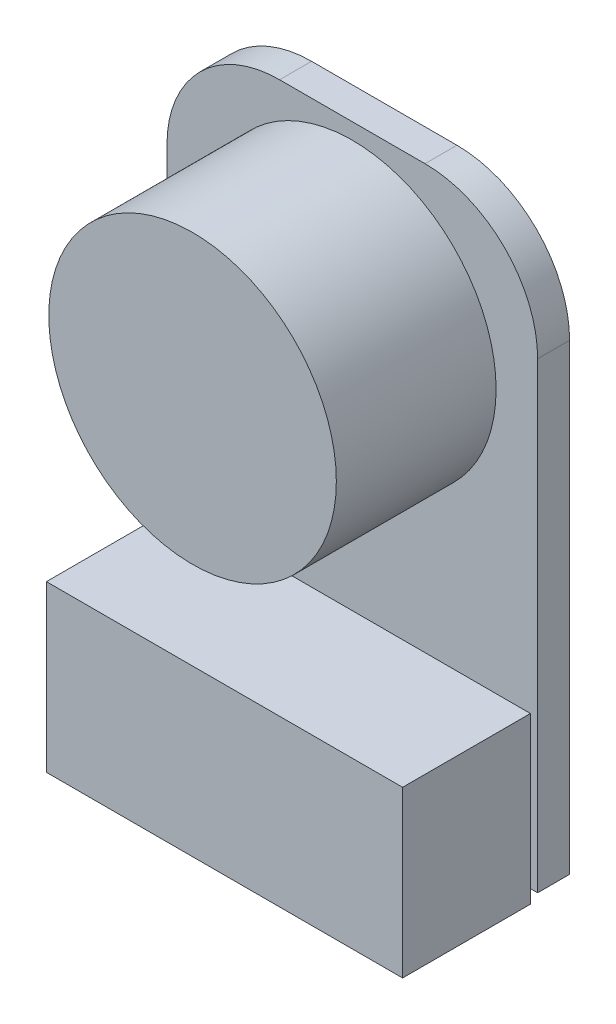
ISO-10303-21;
HEADER;
FILE_DESCRIPTION(('STEP AP214'),'2;1');
FILE_NAME('part.step','',(''),(''),'','','');
FILE_SCHEMA(('AUTOMOTIVE_DESIGN { 1 0 10303 214 1 1 1 1 }'));
ENDSEC;
DATA;
#1=APPLICATION_CONTEXT('core data for automotive mechanical design processes');
#2=APPLICATION_PROTOCOL_DEFINITION('international standard','automotive_design',2000,#1);
#3=PRODUCT_CONTEXT('',#1,'mechanical');
#4=PRODUCT('Part','Part','',(#3));
#5=PRODUCT_RELATED_PRODUCT_CATEGORY('part','',(#4));
#6=PRODUCT_DEFINITION_FORMATION('','',#4);
#7=PRODUCT_DEFINITION_CONTEXT('part definition',#1,'design');
#8=PRODUCT_DEFINITION('design','',#6,#7);
#9=PRODUCT_DEFINITION_SHAPE('','',#8);
#10=(LENGTH_UNIT() NAMED_UNIT(*) SI_UNIT(.MILLI.,.METRE.));
#11=(NAMED_UNIT(*) PLANE_ANGLE_UNIT() SI_UNIT($,.RADIAN.));
#12=(NAMED_UNIT(*) SI_UNIT($,.STERADIAN.) SOLID_ANGLE_UNIT());
#13=UNCERTAINTY_MEASURE_WITH_UNIT(LENGTH_MEASURE(1.E-05),#10,'distance_accuracy_value','');
#14=(GEOMETRIC_REPRESENTATION_CONTEXT(3) GLOBAL_UNCERTAINTY_ASSIGNED_CONTEXT((#13)) GLOBAL_UNIT_ASSIGNED_CONTEXT((#10,
#11,#12)) REPRESENTATION_CONTEXT('',''));
#15=CARTESIAN_POINT('',(0.,0.,0.));
#16=DIRECTION('',(0.,0.,1.));
#17=DIRECTION('',(1.,0.,0.));
#18=AXIS2_PLACEMENT_3D('',#15,#16,#17);
#19=CARTESIAN_POINT('',(2.27500741064341,1.4743834517031,1.));
#20=DIRECTION('',(0.,0.,1.));
#21=DIRECTION('',(1.,0.,0.));
#22=AXIS2_PLACEMENT_3D('',#19,#20,#21);
#23=PLANE('',#22);
#24=CARTESIAN_POINT('',(0.,0.,1.));
#25=DIRECTION('',(0.,0.,1.));
#26=DIRECTION('',(1.,0.,0.));
#27=AXIS2_PLACEMENT_3D('',#24,#25,#26);
#28=CIRCLE('',#27,4.5);
#29=CARTESIAN_POINT('',(4.5,0.,1.));
#30=VERTEX_POINT('',#29);
#31=EDGE_CURVE('E48',#30,#30,#28,.T.);
#32=ORIENTED_EDGE('',*,*,#31,.F.);
#33=EDGE_LOOP('',(#32));
#34=FACE_BOUND('',#33,.T.);
#35=DIRECTION('',(-1.,0.,0.));
#36=VECTOR('',#35,1.);
#37=CARTESIAN_POINT('',(-5.57418792924603,-8.25322151892993,1.));
#38=LINE('',#37,#36);
#39=CARTESIAN_POINT('',(5.57418792924603,-8.25322151892993,1.));
#40=VERTEX_POINT('',#39);
#41=CARTESIAN_POINT('',(-5.57418792924603,-8.25322151892993,1.));
#42=VERTEX_POINT('',#41);
#43=EDGE_CURVE('E392',#40,#42,#38,.T.);
#44=ORIENTED_EDGE('',*,*,#43,.F.);
#45=DIRECTION('',(0.,-1.,0.));
#46=VECTOR('',#45,1.);
#47=CARTESIAN_POINT('',(5.57418792924603,1.4743834517031,1.));
#48=LINE('',#47,#46);
#49=CARTESIAN_POINT('',(5.57418792924603,-13.,1.));
#50=VERTEX_POINT('',#49);
#51=EDGE_CURVE('E11',#40,#50,#48,.T.);
#52=ORIENTED_EDGE('',*,*,#51,.T.);
#53=DIRECTION('',(1.,0.,0.));
#54=VECTOR('',#53,1.);
#55=CARTESIAN_POINT('',(-5.80062395894031,-13.,1.));
#56=LINE('',#55,#54);
#57=CARTESIAN_POINT('',(5.80062395894031,-13.,1.));
#58=VERTEX_POINT('',#57);
#59=EDGE_CURVE('E121',#50,#58,#56,.T.);
#60=ORIENTED_EDGE('',*,*,#59,.T.);
#61=DIRECTION('',(0.,-1.,0.));
#62=VECTOR('',#61,1.);
#63=CARTESIAN_POINT('',(5.80062395894031,1.4743834517031,1.));
#64=LINE('',#63,#62);
#65=CARTESIAN_POINT('',(5.80062395894031,1.4743834517031,1.));
#66=VERTEX_POINT('',#65);
#67=EDGE_CURVE('E141',#66,#58,#64,.T.);
#68=ORIENTED_EDGE('',*,*,#67,.F.);
#69=CARTESIAN_POINT('',(2.27500741064341,1.4743834517031,1.));
#70=DIRECTION('',(0.,0.,1.));
#71=DIRECTION('',(1.,0.,0.));
#72=AXIS2_PLACEMENT_3D('',#69,#70,#71);
#73=CIRCLE('',#72,3.5256165482969);
#74=CARTESIAN_POINT('',(2.27500741064341,5.,1.));
#75=VERTEX_POINT('',#74);
#76=EDGE_CURVE('E97',#66,#75,#73,.T.);
#77=ORIENTED_EDGE('',*,*,#76,.T.);
#78=DIRECTION('',(1.,0.,0.));
#79=VECTOR('',#78,1.);
#80=CARTESIAN_POINT('',(-2.27500741064341,5.,1.));
#81=LINE('',#80,#79);
#82=CARTESIAN_POINT('',(-2.27500741064341,5.,1.));
#83=VERTEX_POINT('',#82);
#84=EDGE_CURVE('E249',#83,#75,#81,.T.);
#85=ORIENTED_EDGE('',*,*,#84,.F.);
#86=CARTESIAN_POINT('',(-2.27500741064341,1.4743834517031,1.));
#87=DIRECTION('',(0.,0.,-1.));
#88=DIRECTION('',(-1.,0.,0.));
#89=AXIS2_PLACEMENT_3D('',#86,#87,#88);
#90=CIRCLE('',#89,3.5256165482969);
#91=CARTESIAN_POINT('',(-5.80062395894031,1.4743834517031,1.));
#92=VERTEX_POINT('',#91);
#93=EDGE_CURVE('E118',#92,#83,#90,.T.);
#94=ORIENTED_EDGE('',*,*,#93,.F.);
#95=DIRECTION('',(0.,-1.,0.));
#96=VECTOR('',#95,1.);
#97=CARTESIAN_POINT('',(-5.80062395894031,1.4743834517031,1.));
#98=LINE('',#97,#96);
#99=CARTESIAN_POINT('',(-5.80062395894031,-13.,1.));
#100=VERTEX_POINT('',#99);
#101=EDGE_CURVE('E110',#92,#100,#98,.T.);
#102=ORIENTED_EDGE('',*,*,#101,.T.);
#103=CARTESIAN_POINT('',(-5.57418792924603,-13.,1.));
#104=VERTEX_POINT('',#103);
#105=EDGE_CURVE('E116',#100,#104,#56,.T.);
#106=ORIENTED_EDGE('',*,*,#105,.T.);
#107=DIRECTION('',(0.,-1.,0.));
#108=VECTOR('',#107,1.);
#109=CARTESIAN_POINT('',(-5.57418792924603,-8.25322151892993,1.));
#110=LINE('',#109,#108);
#111=EDGE_CURVE('E388',#42,#104,#110,.T.);
#112=ORIENTED_EDGE('',*,*,#111,.F.);
#113=EDGE_LOOP('',(#44,#52,#60,#68,#77,#85,#94,#102,#106,#112));
#114=FACE_BOUND('',#113,.T.);
#115=ADVANCED_FACE('F39',(#34,#114),#23,.T.);
#116=CARTESIAN_POINT('',(2.27500741064341,1.4743834517031,1.));
#117=DIRECTION('',(0.,0.,-1.));
#118=DIRECTION('',(-1.,0.,0.));
#119=AXIS2_PLACEMENT_3D('',#116,#117,#118);
#120=CYLINDRICAL_SURFACE('',#119,3.5256165482969);
#121=CARTESIAN_POINT('',(2.27500741064341,1.4743834517031,0.));
#122=DIRECTION('',(0.,0.,1.));
#123=DIRECTION('',(1.,0.,0.));
#124=AXIS2_PLACEMENT_3D('',#121,#122,#123);
#125=CIRCLE('',#124,3.5256165482969);
#126=CARTESIAN_POINT('',(5.80062395894031,1.4743834517031,0.));
#127=VERTEX_POINT('',#126);
#128=CARTESIAN_POINT('',(2.27500741064341,5.,0.));
#129=VERTEX_POINT('',#128);
#130=EDGE_CURVE('E237',#127,#129,#125,.T.);
#131=ORIENTED_EDGE('',*,*,#130,.T.);
#132=DIRECTION('',(0.,0.,-1.));
#133=VECTOR('',#132,1.);
#134=CARTESIAN_POINT('',(2.27500741064341,5.,1.));
#135=LINE('',#134,#133);
#136=EDGE_CURVE('E246',#75,#129,#135,.T.);
#137=ORIENTED_EDGE('',*,*,#136,.F.);
#138=ORIENTED_EDGE('',*,*,#76,.F.);
#139=DIRECTION('',(0.,0.,-1.));
#140=VECTOR('',#139,1.);
#141=CARTESIAN_POINT('',(5.80062395894031,1.4743834517031,1.));
#142=LINE('',#141,#140);
#143=EDGE_CURVE('E64',#66,#127,#142,.T.);
#144=ORIENTED_EDGE('',*,*,#143,.T.);
#145=EDGE_LOOP('',(#131,#137,#138,#144));
#146=FACE_BOUND('',#145,.T.);
#147=ADVANCED_FACE('F41',(#146),#120,.T.);
#148=CARTESIAN_POINT('',(-2.27500741064341,5.,1.));
#149=DIRECTION('',(0.,1.,0.));
#150=DIRECTION('',(0.,0.,1.));
#151=AXIS2_PLACEMENT_3D('',#148,#149,#150);
#152=PLANE('',#151);
#153=DIRECTION('',(1.,0.,0.));
#154=VECTOR('',#153,1.);
#155=CARTESIAN_POINT('',(-2.27500741064341,5.,0.));
#156=LINE('',#155,#154);
#157=CARTESIAN_POINT('',(-2.27500741064341,5.,0.));
#158=VERTEX_POINT('',#157);
#159=EDGE_CURVE('E268',#158,#129,#156,.T.);
#160=ORIENTED_EDGE('',*,*,#159,.F.);
#161=DIRECTION('',(0.,0.,-1.));
#162=VECTOR('',#161,1.);
#163=CARTESIAN_POINT('',(-2.27500741064341,5.,1.));
#164=LINE('',#163,#162);
#165=EDGE_CURVE('E257',#83,#158,#164,.T.);
#166=ORIENTED_EDGE('',*,*,#165,.F.);
#167=ORIENTED_EDGE('',*,*,#84,.T.);
#168=ORIENTED_EDGE('',*,*,#136,.T.);
#169=EDGE_LOOP('',(#160,#166,#167,#168));
#170=FACE_BOUND('',#169,.T.);
#171=ADVANCED_FACE('F172',(#170),#152,.T.);
#172=CARTESIAN_POINT('',(-2.27500741064341,1.4743834517031,1.));
#173=DIRECTION('',(0.,0.,-1.));
#174=DIRECTION('',(-1.,0.,0.));
#175=AXIS2_PLACEMENT_3D('',#172,#173,#174);
#176=CYLINDRICAL_SURFACE('',#175,3.5256165482969);
#177=CARTESIAN_POINT('',(-2.27500741064341,1.4743834517031,0.));
#178=DIRECTION('',(0.,0.,-1.));
#179=DIRECTION('',(-1.,0.,0.));
#180=AXIS2_PLACEMENT_3D('',#177,#178,#179);
#181=CIRCLE('',#180,3.5256165482969);
#182=CARTESIAN_POINT('',(-5.80062395894031,1.4743834517031,0.));
#183=VERTEX_POINT('',#182);
#184=EDGE_CURVE('E260',#183,#158,#181,.T.);
#185=ORIENTED_EDGE('',*,*,#184,.F.);
#186=DIRECTION('',(0.,0.,-1.));
#187=VECTOR('',#186,1.);
#188=CARTESIAN_POINT('',(-5.80062395894031,1.4743834517031,1.));
#189=LINE('',#188,#187);
#190=EDGE_CURVE('E132',#92,#183,#189,.T.);
#191=ORIENTED_EDGE('',*,*,#190,.F.);
#192=ORIENTED_EDGE('',*,*,#93,.T.);
#193=ORIENTED_EDGE('',*,*,#165,.T.);
#194=EDGE_LOOP('',(#185,#191,#192,#193));
#195=FACE_BOUND('',#194,.T.);
#196=ADVANCED_FACE('F256',(#195),#176,.T.);
#197=CARTESIAN_POINT('',(-5.80062395894031,1.4743834517031,1.));
#198=DIRECTION('',(1.,0.,0.));
#199=DIRECTION('',(0.,1.,0.));
#200=AXIS2_PLACEMENT_3D('',#197,#198,#199);
#201=PLANE('',#200);
#202=DIRECTION('',(0.,-1.,0.));
#203=VECTOR('',#202,1.);
#204=CARTESIAN_POINT('',(-5.80062395894031,1.4743834517031,0.));
#205=LINE('',#204,#203);
#206=CARTESIAN_POINT('',(-5.80062395894031,-13.,0.));
#207=VERTEX_POINT('',#206);
#208=EDGE_CURVE('E127',#183,#207,#205,.T.);
#209=ORIENTED_EDGE('',*,*,#208,.T.);
#210=DIRECTION('',(0.,0.,-1.));
#211=VECTOR('',#210,1.);
#212=CARTESIAN_POINT('',(-5.80062395894031,-13.,1.));
#213=LINE('',#212,#211);
#214=EDGE_CURVE('E124',#100,#207,#213,.T.);
#215=ORIENTED_EDGE('',*,*,#214,.F.);
#216=ORIENTED_EDGE('',*,*,#101,.F.);
#217=ORIENTED_EDGE('',*,*,#190,.T.);
#218=EDGE_LOOP('',(#209,#215,#216,#217));
#219=FACE_BOUND('',#218,.T.);
#220=ADVANCED_FACE('F125',(#219),#201,.F.);
#221=CARTESIAN_POINT('',(-5.80062395894031,-13.,1.));
#222=DIRECTION('',(0.,1.,0.));
#223=DIRECTION('',(0.,0.,1.));
#224=AXIS2_PLACEMENT_3D('',#221,#222,#223);
#225=PLANE('',#224);
#226=DIRECTION('',(1.,0.,0.));
#227=VECTOR('',#226,1.);
#228=CARTESIAN_POINT('',(-5.80062395894031,-13.,0.));
#229=LINE('',#228,#227);
#230=CARTESIAN_POINT('',(5.80062395894031,-13.,0.));
#231=VERTEX_POINT('',#230);
#232=EDGE_CURVE('E149',#207,#231,#229,.T.);
#233=ORIENTED_EDGE('',*,*,#232,.T.);
#234=DIRECTION('',(0.,0.,-1.));
#235=VECTOR('',#234,1.);
#236=CARTESIAN_POINT('',(5.80062395894031,-13.,1.));
#237=LINE('',#236,#235);
#238=EDGE_CURVE('E133',#58,#231,#237,.T.);
#239=ORIENTED_EDGE('',*,*,#238,.F.);
#240=ORIENTED_EDGE('',*,*,#59,.F.);
#241=EDGE_CURVE('E139',#104,#50,#56,.T.);
#242=ORIENTED_EDGE('',*,*,#241,.F.);
#243=ORIENTED_EDGE('',*,*,#105,.F.);
#244=ORIENTED_EDGE('',*,*,#214,.T.);
#245=EDGE_LOOP('',(#233,#239,#240,#242,#243,#244));
#246=FACE_BOUND('',#245,.T.);
#247=ADVANCED_FACE('F136',(#246),#225,.F.);
#248=CARTESIAN_POINT('',(5.80062395894031,1.4743834517031,1.));
#249=DIRECTION('',(1.,0.,0.));
#250=DIRECTION('',(0.,1.,0.));
#251=AXIS2_PLACEMENT_3D('',#248,#249,#250);
#252=PLANE('',#251);
#253=DIRECTION('',(0.,-1.,0.));
#254=VECTOR('',#253,1.);
#255=CARTESIAN_POINT('',(5.80062395894031,1.4743834517031,0.));
#256=LINE('',#255,#254);
#257=EDGE_CURVE('E154',#127,#231,#256,.T.);
#258=ORIENTED_EDGE('',*,*,#257,.F.);
#259=ORIENTED_EDGE('',*,*,#143,.F.);
#260=ORIENTED_EDGE('',*,*,#67,.T.);
#261=ORIENTED_EDGE('',*,*,#238,.T.);
#262=EDGE_LOOP('',(#258,#259,#260,#261));
#263=FACE_BOUND('',#262,.T.);
#264=ADVANCED_FACE('F153',(#263),#252,.T.);
#265=CARTESIAN_POINT('',(2.27500741064341,1.4743834517031,0.));
#266=DIRECTION('',(0.,0.,1.));
#267=DIRECTION('',(1.,0.,0.));
#268=AXIS2_PLACEMENT_3D('',#265,#266,#267);
#269=PLANE('',#268);
#270=ORIENTED_EDGE('',*,*,#130,.F.);
#271=ORIENTED_EDGE('',*,*,#257,.T.);
#272=ORIENTED_EDGE('',*,*,#232,.F.);
#273=ORIENTED_EDGE('',*,*,#208,.F.);
#274=ORIENTED_EDGE('',*,*,#184,.T.);
#275=ORIENTED_EDGE('',*,*,#159,.T.);
#276=EDGE_LOOP('',(#270,#271,#272,#273,#274,#275));
#277=FACE_BOUND('',#276,.T.);
#278=ADVANCED_FACE('F156',(#277),#269,.F.);
#279=CARTESIAN_POINT('',(0.,0.,6.));
#280=DIRECTION('',(0.,0.,-1.));
#281=DIRECTION('',(-1.,0.,0.));
#282=AXIS2_PLACEMENT_3D('',#279,#280,#281);
#283=CYLINDRICAL_SURFACE('',#282,4.5);
#284=CARTESIAN_POINT('',(0.,0.,6.));
#285=DIRECTION('',(0.,0.,1.));
#286=DIRECTION('',(1.,0.,0.));
#287=AXIS2_PLACEMENT_3D('',#284,#285,#286);
#288=CIRCLE('',#287,4.5);
#289=CARTESIAN_POINT('',(4.5,0.,6.));
#290=VERTEX_POINT('',#289);
#291=EDGE_CURVE('E232',#290,#290,#288,.T.);
#292=ORIENTED_EDGE('',*,*,#291,.F.);
#293=EDGE_LOOP('',(#292));
#294=FACE_BOUND('',#293,.T.);
#295=ORIENTED_EDGE('',*,*,#31,.T.);
#296=EDGE_LOOP('',(#295));
#297=FACE_BOUND('',#296,.T.);
#298=ADVANCED_FACE('F162',(#294,#297),#283,.T.);
#299=CARTESIAN_POINT('',(0.,0.,6.));
#300=DIRECTION('',(0.,0.,1.));
#301=DIRECTION('',(1.,0.,0.));
#302=AXIS2_PLACEMENT_3D('',#299,#300,#301);
#303=PLANE('',#302);
#304=ORIENTED_EDGE('',*,*,#291,.T.);
#305=EDGE_LOOP('',(#304));
#306=FACE_BOUND('',#305,.T.);
#307=ADVANCED_FACE('F177',(#306),#303,.T.);
#308=CARTESIAN_POINT('',(0.,0.,1.));
#309=DIRECTION('',(0.,0.,1.));
#310=DIRECTION('',(1.,0.,0.));
#311=AXIS2_PLACEMENT_3D('',#308,#309,#310);
#312=PLANE('',#311);
#313=CARTESIAN_POINT('',(-5.57418792924603,-13.4226284553096,1.));
#314=VERTEX_POINT('',#313);
#315=EDGE_CURVE('E391',#104,#314,#110,.T.);
#316=ORIENTED_EDGE('',*,*,#315,.F.);
#317=ORIENTED_EDGE('',*,*,#241,.T.);
#318=DIRECTION('',(0.,1.,0.));
#319=VECTOR('',#318,1.);
#320=CARTESIAN_POINT('',(5.57418792924603,-8.25322151892993,1.));
#321=LINE('',#320,#319);
#322=CARTESIAN_POINT('',(5.57418792924603,-13.4226284553096,1.));
#323=VERTEX_POINT('',#322);
#324=EDGE_CURVE('E395',#323,#50,#321,.T.);
#325=ORIENTED_EDGE('',*,*,#324,.F.);
#326=DIRECTION('',(1.,0.,0.));
#327=VECTOR('',#326,1.);
#328=CARTESIAN_POINT('',(-5.57418792924603,-13.4226284553096,1.));
#329=LINE('',#328,#327);
#330=EDGE_CURVE('E225',#314,#323,#329,.T.);
#331=ORIENTED_EDGE('',*,*,#330,.F.);
#332=EDGE_LOOP('',(#316,#317,#325,#331));
#333=FACE_BOUND('',#332,.T.);
#334=ADVANCED_FACE('F181',(#333),#312,.F.);
#335=CARTESIAN_POINT('',(5.57418792924603,-8.25322151892993,5.));
#336=DIRECTION('',(-1.,0.,0.));
#337=DIRECTION('',(0.,0.,1.));
#338=AXIS2_PLACEMENT_3D('',#335,#336,#337);
#339=PLANE('',#338);
#340=ORIENTED_EDGE('',*,*,#324,.T.);
#341=ORIENTED_EDGE('',*,*,#51,.F.);
#342=DIRECTION('',(0.,0.,-1.));
#343=VECTOR('',#342,1.);
#344=CARTESIAN_POINT('',(5.57418792924603,-8.25322151892993,5.));
#345=LINE('',#344,#343);
#346=CARTESIAN_POINT('',(5.57418792924603,-8.25322151892993,5.));
#347=VERTEX_POINT('',#346);
#348=EDGE_CURVE('E228',#347,#40,#345,.T.);
#349=ORIENTED_EDGE('',*,*,#348,.F.);
#350=DIRECTION('',(0.,1.,0.));
#351=VECTOR('',#350,1.);
#352=CARTESIAN_POINT('',(5.57418792924603,-8.25322151892993,5.));
#353=LINE('',#352,#351);
#354=CARTESIAN_POINT('',(5.57418792924603,-13.4226284553096,5.));
#355=VERTEX_POINT('',#354);
#356=EDGE_CURVE('E211',#355,#347,#353,.T.);
#357=ORIENTED_EDGE('',*,*,#356,.F.);
#358=DIRECTION('',(0.,0.,-1.));
#359=VECTOR('',#358,1.);
#360=CARTESIAN_POINT('',(5.57418792924603,-13.4226284553096,5.));
#361=LINE('',#360,#359);
#362=EDGE_CURVE('E382',#355,#323,#361,.T.);
#363=ORIENTED_EDGE('',*,*,#362,.T.);
#364=EDGE_LOOP('',(#340,#341,#349,#357,#363));
#365=FACE_BOUND('',#364,.T.);
#366=ADVANCED_FACE('F183',(#365),#339,.F.);
#367=CARTESIAN_POINT('',(-5.57418792924603,-8.25322151892993,5.));
#368=DIRECTION('',(0.,-1.,0.));
#369=DIRECTION('',(0.,0.,-1.));
#370=AXIS2_PLACEMENT_3D('',#367,#368,#369);
#371=PLANE('',#370);
#372=ORIENTED_EDGE('',*,*,#43,.T.);
#373=DIRECTION('',(0.,0.,-1.));
#374=VECTOR('',#373,1.);
#375=CARTESIAN_POINT('',(-5.57418792924603,-8.25322151892993,5.));
#376=LINE('',#375,#374);
#377=CARTESIAN_POINT('',(-5.57418792924603,-8.25322151892993,5.));
#378=VERTEX_POINT('',#377);
#379=EDGE_CURVE('E55',#378,#42,#376,.T.);
#380=ORIENTED_EDGE('',*,*,#379,.F.);
#381=DIRECTION('',(-1.,0.,0.));
#382=VECTOR('',#381,1.);
#383=CARTESIAN_POINT('',(-5.57418792924603,-8.25322151892993,5.));
#384=LINE('',#383,#382);
#385=EDGE_CURVE('E216',#347,#378,#384,.T.);
#386=ORIENTED_EDGE('',*,*,#385,.F.);
#387=ORIENTED_EDGE('',*,*,#348,.T.);
#388=EDGE_LOOP('',(#372,#380,#386,#387));
#389=FACE_BOUND('',#388,.T.);
#390=ADVANCED_FACE('F186',(#389),#371,.F.);
#391=CARTESIAN_POINT('',(-5.57418792924603,-8.25322151892993,5.));
#392=DIRECTION('',(1.,0.,0.));
#393=DIRECTION('',(0.,0.,-1.));
#394=AXIS2_PLACEMENT_3D('',#391,#392,#393);
#395=PLANE('',#394);
#396=ORIENTED_EDGE('',*,*,#111,.T.);
#397=ORIENTED_EDGE('',*,*,#315,.T.);
#398=DIRECTION('',(0.,0.,-1.));
#399=VECTOR('',#398,1.);
#400=CARTESIAN_POINT('',(-5.57418792924603,-13.4226284553096,5.));
#401=LINE('',#400,#399);
#402=CARTESIAN_POINT('',(-5.57418792924603,-13.4226284553096,5.));
#403=VERTEX_POINT('',#402);
#404=EDGE_CURVE('E239',#403,#314,#401,.T.);
#405=ORIENTED_EDGE('',*,*,#404,.F.);
#406=DIRECTION('',(0.,-1.,0.));
#407=VECTOR('',#406,1.);
#408=CARTESIAN_POINT('',(-5.57418792924603,-8.25322151892993,5.));
#409=LINE('',#408,#407);
#410=EDGE_CURVE('E400',#378,#403,#409,.T.);
#411=ORIENTED_EDGE('',*,*,#410,.F.);
#412=ORIENTED_EDGE('',*,*,#379,.T.);
#413=EDGE_LOOP('',(#396,#397,#405,#411,#412));
#414=FACE_BOUND('',#413,.T.);
#415=ADVANCED_FACE('F190',(#414),#395,.F.);
#416=CARTESIAN_POINT('',(-5.57418792924603,-13.4226284553096,5.));
#417=DIRECTION('',(0.,1.,0.));
#418=DIRECTION('',(0.,0.,1.));
#419=AXIS2_PLACEMENT_3D('',#416,#417,#418);
#420=PLANE('',#419);
#421=ORIENTED_EDGE('',*,*,#330,.T.);
#422=ORIENTED_EDGE('',*,*,#362,.F.);
#423=DIRECTION('',(1.,0.,0.));
#424=VECTOR('',#423,1.);
#425=CARTESIAN_POINT('',(-5.57418792924603,-13.4226284553096,5.));
#426=LINE('',#425,#424);
#427=EDGE_CURVE('E219',#403,#355,#426,.T.);
#428=ORIENTED_EDGE('',*,*,#427,.F.);
#429=ORIENTED_EDGE('',*,*,#404,.T.);
#430=EDGE_LOOP('',(#421,#422,#428,#429));
#431=FACE_BOUND('',#430,.T.);
#432=ADVANCED_FACE('F194',(#431),#420,.F.);
#433=CARTESIAN_POINT('',(0.,0.,5.));
#434=DIRECTION('',(0.,0.,1.));
#435=DIRECTION('',(1.,0.,0.));
#436=AXIS2_PLACEMENT_3D('',#433,#434,#435);
#437=PLANE('',#436);
#438=ORIENTED_EDGE('',*,*,#356,.T.);
#439=ORIENTED_EDGE('',*,*,#385,.T.);
#440=ORIENTED_EDGE('',*,*,#410,.T.);
#441=ORIENTED_EDGE('',*,*,#427,.T.);
#442=EDGE_LOOP('',(#438,#439,#440,#441));
#443=FACE_BOUND('',#442,.T.);
#444=ADVANCED_FACE('F197',(#443),#437,.T.);
#445=CLOSED_SHELL('',(#115,#147,#171,#196,#220,#247,#264,#278,#298,#307,#334,#366,#390,#415,
#432,#444));
#446=MANIFOLD_SOLID_BREP('B2',#445);
#447=ADVANCED_BREP_SHAPE_REPRESENTATION('',(#18,#446),#14);
#448=SHAPE_DEFINITION_REPRESENTATION(#9,#447);
ENDSEC;
END-ISO-10303-21;
